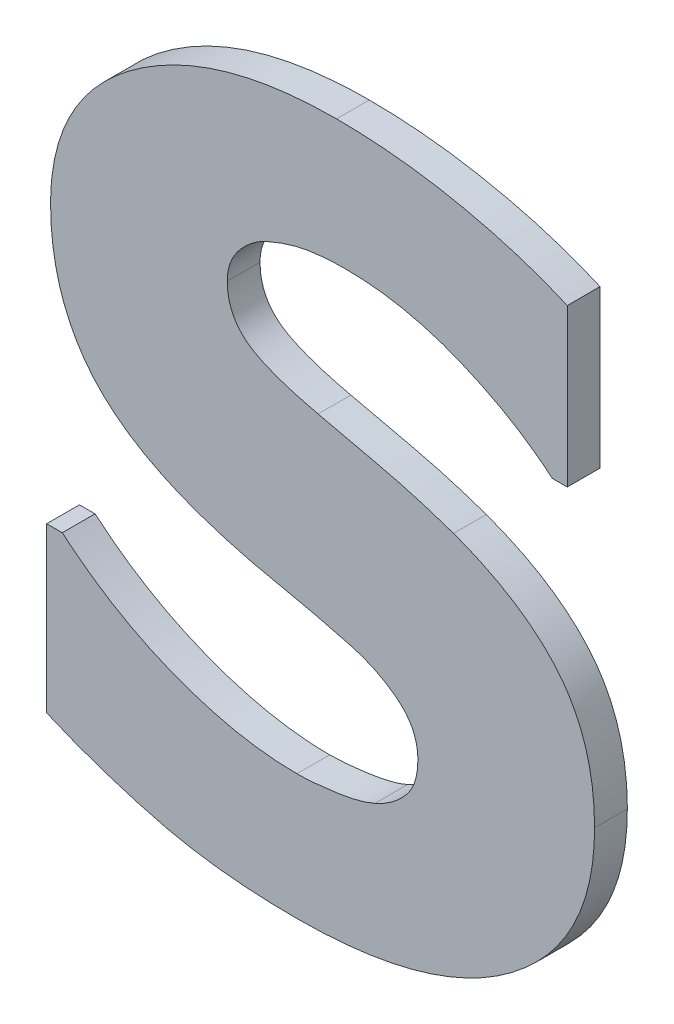
ISO-10303-21;
HEADER;
FILE_DESCRIPTION(('STEP AP214'),'2;1');
FILE_NAME('part.step','',(''),(''),'','','');
FILE_SCHEMA(('AUTOMOTIVE_DESIGN { 1 0 10303 214 1 1 1 1 }'));
ENDSEC;
DATA;
#1=APPLICATION_CONTEXT('core data for automotive mechanical design processes');
#2=APPLICATION_PROTOCOL_DEFINITION('international standard','automotive_design',2000,#1);
#3=PRODUCT_CONTEXT('',#1,'mechanical');
#4=PRODUCT('Part','Part','',(#3));
#5=PRODUCT_RELATED_PRODUCT_CATEGORY('part','',(#4));
#6=PRODUCT_DEFINITION_FORMATION('','',#4);
#7=PRODUCT_DEFINITION_CONTEXT('part definition',#1,'design');
#8=PRODUCT_DEFINITION('design','',#6,#7);
#9=PRODUCT_DEFINITION_SHAPE('','',#8);
#10=(LENGTH_UNIT() NAMED_UNIT(*) SI_UNIT(.MILLI.,.METRE.));
#11=(NAMED_UNIT(*) PLANE_ANGLE_UNIT() SI_UNIT($,.RADIAN.));
#12=(NAMED_UNIT(*) SI_UNIT($,.STERADIAN.) SOLID_ANGLE_UNIT());
#13=UNCERTAINTY_MEASURE_WITH_UNIT(LENGTH_MEASURE(1.E-05),#10,'distance_accuracy_value','');
#14=(GEOMETRIC_REPRESENTATION_CONTEXT(3) GLOBAL_UNCERTAINTY_ASSIGNED_CONTEXT((#13)) GLOBAL_UNIT_ASSIGNED_CONTEXT((#10,
#11,#12)) REPRESENTATION_CONTEXT('',''));
#15=CARTESIAN_POINT('',(0.,0.,0.));
#16=DIRECTION('',(0.,0.,1.));
#17=DIRECTION('',(1.,0.,0.));
#18=AXIS2_PLACEMENT_3D('',#15,#16,#17);
#19=CARTESIAN_POINT('',(3.2352198611794,-3.1542803303733,0.0475));
#20=DIRECTION('',(-1.,0.,0.));
#21=DIRECTION('',(0.,-1.,0.));
#22=AXIS2_PLACEMENT_3D('',#19,#20,#21);
#23=PLANE('',#22);
#24=DIRECTION('',(0.,1.,0.));
#25=VECTOR('',#24,1.);
#26=CARTESIAN_POINT('',(3.2352198611794,-3.1792965370477,0.0475));
#27=LINE('',#26,#25);
#28=CARTESIAN_POINT('',(3.2352198611794,-3.1792965370477,0.0475));
#29=VERTEX_POINT('',#28);
#30=CARTESIAN_POINT('',(3.2352198611794,-3.1542803303733,0.0475));
#31=VERTEX_POINT('',#30);
#32=EDGE_CURVE('E11',#29,#31,#27,.T.);
#33=ORIENTED_EDGE('',*,*,#32,.F.);
#34=DIRECTION('',(0.,0.,1.));
#35=VECTOR('',#34,1.);
#36=CARTESIAN_POINT('',(3.2352198611794,-3.1792965370477,0.0475));
#37=LINE('',#36,#35);
#38=CARTESIAN_POINT('',(3.2352198611794,-3.1792965370477,0.0525));
#39=VERTEX_POINT('',#38);
#40=EDGE_CURVE('E24',#29,#39,#37,.T.);
#41=ORIENTED_EDGE('',*,*,#40,.T.);
#42=DIRECTION('',(0.,-1.,0.));
#43=VECTOR('',#42,1.);
#44=CARTESIAN_POINT('',(3.2352198611794,-3.1792965370477,0.0525));
#45=LINE('',#44,#43);
#46=CARTESIAN_POINT('',(3.2352198611794,-3.1542803303733,0.0525));
#47=VERTEX_POINT('',#46);
#48=EDGE_CURVE('E172',#47,#39,#45,.T.);
#49=ORIENTED_EDGE('',*,*,#48,.F.);
#50=DIRECTION('',(0.,0.,1.));
#51=VECTOR('',#50,1.);
#52=CARTESIAN_POINT('',(3.2352198611794,-3.1542803303733,0.0475));
#53=LINE('',#52,#51);
#54=EDGE_CURVE('E469',#31,#47,#53,.T.);
#55=ORIENTED_EDGE('',*,*,#54,.F.);
#56=EDGE_LOOP('',(#33,#41,#49,#55));
#57=FACE_BOUND('',#56,.T.);
#58=ADVANCED_FACE('F17',(#57),#23,.T.);
#59=CARTESIAN_POINT('',(3.2376023570532,-3.1542803303733,0.0475));
#60=DIRECTION('',(0.,1.,0.));
#61=DIRECTION('',(-1.,0.,0.));
#62=AXIS2_PLACEMENT_3D('',#59,#60,#61);
#63=PLANE('',#62);
#64=DIRECTION('',(1.,0.,0.));
#65=VECTOR('',#64,1.);
#66=CARTESIAN_POINT('',(3.2352198611794,-3.1542803303733,0.0475));
#67=LINE('',#66,#65);
#68=CARTESIAN_POINT('',(3.2376023570532,-3.1542803303733,0.0475));
#69=VERTEX_POINT('',#68);
#70=EDGE_CURVE('E467',#31,#69,#67,.T.);
#71=ORIENTED_EDGE('',*,*,#70,.F.);
#72=ORIENTED_EDGE('',*,*,#54,.T.);
#73=DIRECTION('',(-1.,0.,0.));
#74=VECTOR('',#73,1.);
#75=CARTESIAN_POINT('',(3.2352198611794,-3.1542803303733,0.0525));
#76=LINE('',#75,#74);
#77=CARTESIAN_POINT('',(3.2376023570532,-3.1542803303733,0.0525));
#78=VERTEX_POINT('',#77);
#79=EDGE_CURVE('E465',#78,#47,#76,.T.);
#80=ORIENTED_EDGE('',*,*,#79,.F.);
#81=DIRECTION('',(0.,0.,1.));
#82=VECTOR('',#81,1.);
#83=CARTESIAN_POINT('',(3.2376023570532,-3.1542803303733,0.0475));
#84=LINE('',#83,#82);
#85=EDGE_CURVE('E459',#69,#78,#84,.T.);
#86=ORIENTED_EDGE('',*,*,#85,.F.);
#87=EDGE_LOOP('',(#71,#72,#80,#86));
#88=FACE_BOUND('',#87,.T.);
#89=ADVANCED_FACE('F539',(#88),#63,.T.);
#90=CARTESIAN_POINT('',(3.2734248842978,-3.1682349490624,0.0475));
#91=CARTESIAN_POINT('',(3.2734248842978,-3.1682349490624,0.0525));
#92=CARTESIAN_POINT('',(3.2644905247712,-3.1682349490624,0.0475));
#93=CARTESIAN_POINT('',(3.2644905247712,-3.1682349490624,0.0525));
#94=CARTESIAN_POINT('',(3.2455156469196,-3.1610023723028,0.0475));
#95=CARTESIAN_POINT('',(3.2455156469196,-3.1610023723028,0.0525));
#96=CARTESIAN_POINT('',(3.2376023570532,-3.1542803303733,0.0475));
#97=CARTESIAN_POINT('',(3.2376023570532,-3.1542803303733,0.0525));
#98=B_SPLINE_SURFACE_WITH_KNOTS('',2,1,((#90,#91),(#92,#93),(#94,#95),(#96,#97)),.UNSPECIFIED.,
.F.,.F.,.F.,(3,1,3),(2,2),(-2.,-1.,0.),(0.,0.01),.UNSPECIFIED.);
#99=CARTESIAN_POINT('',(3.2376023570532,-3.1542803303733,0.0475));
#100=CARTESIAN_POINT('',(3.2455156469196,-3.1610023723028,0.0475));
#101=CARTESIAN_POINT('',(3.2644905247712,-3.1682349490624,0.0475));
#102=CARTESIAN_POINT('',(3.2734248842978,-3.1682349490624,0.0475));
#103=B_SPLINE_CURVE_WITH_KNOTS('',2,(#99,#100,#101,#102),.UNSPECIFIED.,.F.,.F.,(3,1,3),(0.,1.,
2.),.UNSPECIFIED.);
#104=CARTESIAN_POINT('',(3.2734248842978,-3.1682349490624,0.0475));
#105=VERTEX_POINT('',#104);
#106=EDGE_CURVE('E452',#69,#105,#103,.T.);
#107=CARTESIAN_POINT('',(3.2734248842978,-3.1682349490624,0.0525));
#108=CARTESIAN_POINT('',(3.2644905247712,-3.1682349490624,0.0525));
#109=CARTESIAN_POINT('',(3.2455156469196,-3.1610023723028,0.0525));
#110=CARTESIAN_POINT('',(3.2376023570532,-3.1542803303733,0.0525));
#111=B_SPLINE_CURVE_WITH_KNOTS('',2,(#107,#108,#109,#110),.UNSPECIFIED.,.F.,.F.,(3,1,3),(-2.,
-1.,0.),.UNSPECIFIED.);
#112=CARTESIAN_POINT('',(3.2734248842978,-3.1682349490624,0.0525));
#113=VERTEX_POINT('',#112);
#114=EDGE_CURVE('E447',#113,#78,#111,.T.);
#115=DIRECTION('',(0.,0.,1.));
#116=VECTOR('',#115,1.);
#117=CARTESIAN_POINT('',(3.2734248842978,-3.1682349490624,0.0475));
#118=LINE('',#117,#116);
#119=EDGE_CURVE('E441',#105,#113,#118,.T.);
#120=ORIENTED_EDGE('',*,*,#106,.F.);
#121=ORIENTED_EDGE('',*,*,#85,.T.);
#122=ORIENTED_EDGE('',*,*,#114,.F.);
#123=ORIENTED_EDGE('',*,*,#119,.F.);
#124=EDGE_LOOP('',(#120,#121,#122,#123));
#125=FACE_BOUND('',#124,.T.);
#126=ADVANCED_FACE('F535',(#125),#98,.T.);
#127=CARTESIAN_POINT('',(3.2853373636666,-3.1661928097421,0.0475));
#128=CARTESIAN_POINT('',(3.2853373636666,-3.1661928097421,0.0525));
#129=CARTESIAN_POINT('',(3.2831250460695,-3.1672138794022,0.0475));
#130=CARTESIAN_POINT('',(3.2831250460695,-3.1672138794022,0.0525));
#131=CARTESIAN_POINT('',(3.2757222910332,-3.1682349490624,0.0475));
#132=CARTESIAN_POINT('',(3.2757222910332,-3.1682349490624,0.0525));
#133=CARTESIAN_POINT('',(3.2734248842978,-3.1682349490624,0.0475));
#134=CARTESIAN_POINT('',(3.2734248842978,-3.1682349490624,0.0525));
#135=B_SPLINE_SURFACE_WITH_KNOTS('',2,1,((#127,#128),(#129,#130),(#131,#132),(#133,#134)),
.UNSPECIFIED.,.F.,.F.,.F.,(3,1,3),(2,2),(-2.,-1.,0.),(0.,0.01),.UNSPECIFIED.);
#136=CARTESIAN_POINT('',(3.2734248842978,-3.1682349490624,0.0475));
#137=CARTESIAN_POINT('',(3.2757222910332,-3.1682349490624,0.0475));
#138=CARTESIAN_POINT('',(3.2831250460695,-3.1672138794022,0.0475));
#139=CARTESIAN_POINT('',(3.2853373636666,-3.1661928097421,0.0475));
#140=B_SPLINE_CURVE_WITH_KNOTS('',2,(#136,#137,#138,#139),.UNSPECIFIED.,.F.,.F.,(3,1,3),(0.,1.,
2.),.UNSPECIFIED.);
#141=CARTESIAN_POINT('',(3.2853373636666,-3.1661928097421,0.0475));
#142=VERTEX_POINT('',#141);
#143=EDGE_CURVE('E434',#105,#142,#140,.T.);
#144=CARTESIAN_POINT('',(3.2853373636666,-3.1661928097421,0.0525));
#145=CARTESIAN_POINT('',(3.2831250460695,-3.1672138794022,0.0525));
#146=CARTESIAN_POINT('',(3.2757222910332,-3.1682349490624,0.0525));
#147=CARTESIAN_POINT('',(3.2734248842978,-3.1682349490624,0.0525));
#148=B_SPLINE_CURVE_WITH_KNOTS('',2,(#144,#145,#146,#147),.UNSPECIFIED.,.F.,.F.,(3,1,3),(-2.,
-1.,0.),.UNSPECIFIED.);
#149=CARTESIAN_POINT('',(3.2853373636666,-3.1661928097421,0.0525));
#150=VERTEX_POINT('',#149);
#151=EDGE_CURVE('E429',#150,#113,#148,.T.);
#152=DIRECTION('',(0.,0.,1.));
#153=VECTOR('',#152,1.);
#154=CARTESIAN_POINT('',(3.2853373636666,-3.1661928097421,0.0475));
#155=LINE('',#154,#153);
#156=EDGE_CURVE('E423',#142,#150,#155,.T.);
#157=ORIENTED_EDGE('',*,*,#143,.F.);
#158=ORIENTED_EDGE('',*,*,#119,.T.);
#159=ORIENTED_EDGE('',*,*,#151,.F.);
#160=ORIENTED_EDGE('',*,*,#156,.F.);
#161=EDGE_LOOP('',(#157,#158,#159,#160));
#162=FACE_BOUND('',#161,.T.);
#163=ADVANCED_FACE('F531',(#162),#135,.T.);
#164=CARTESIAN_POINT('',(3.2918892273194,-3.1571733610771,0.0475));
#165=CARTESIAN_POINT('',(3.2918892273194,-3.1571733610771,0.0525));
#166=CARTESIAN_POINT('',(3.2918892273194,-3.1606620157494,0.0475));
#167=CARTESIAN_POINT('',(3.2918892273194,-3.1606620157494,0.0525));
#168=CARTESIAN_POINT('',(3.2880602160937,-3.1650015618052,0.0475));
#169=CARTESIAN_POINT('',(3.2880602160937,-3.1650015618052,0.0525));
#170=CARTESIAN_POINT('',(3.2853373636666,-3.1661928097421,0.0475));
#171=CARTESIAN_POINT('',(3.2853373636666,-3.1661928097421,0.0525));
#172=B_SPLINE_SURFACE_WITH_KNOTS('',2,1,((#164,#165),(#166,#167),(#168,#169),(#170,#171)),
.UNSPECIFIED.,.F.,.F.,.F.,(3,1,3),(2,2),(-2.,-1.,0.),(0.,0.01),.UNSPECIFIED.);
#173=CARTESIAN_POINT('',(3.2853373636666,-3.1661928097421,0.0475));
#174=CARTESIAN_POINT('',(3.2880602160937,-3.1650015618052,0.0475));
#175=CARTESIAN_POINT('',(3.2918892273194,-3.1606620157494,0.0475));
#176=CARTESIAN_POINT('',(3.2918892273194,-3.1571733610771,0.0475));
#177=B_SPLINE_CURVE_WITH_KNOTS('',2,(#173,#174,#175,#176),.UNSPECIFIED.,.F.,.F.,(3,1,3),(0.,1.,
2.),.UNSPECIFIED.);
#178=CARTESIAN_POINT('',(3.2918892273194,-3.1571733610771,0.0475));
#179=VERTEX_POINT('',#178);
#180=EDGE_CURVE('E416',#142,#179,#177,.T.);
#181=CARTESIAN_POINT('',(3.2918892273194,-3.1571733610771,0.0525));
#182=CARTESIAN_POINT('',(3.2918892273194,-3.1606620157494,0.0525));
#183=CARTESIAN_POINT('',(3.2880602160937,-3.1650015618052,0.0525));
#184=CARTESIAN_POINT('',(3.2853373636666,-3.1661928097421,0.0525));
#185=B_SPLINE_CURVE_WITH_KNOTS('',2,(#181,#182,#183,#184),.UNSPECIFIED.,.F.,.F.,(3,1,3),(-2.,
-1.,0.),.UNSPECIFIED.);
#186=CARTESIAN_POINT('',(3.2918892273194,-3.1571733610771,0.0525));
#187=VERTEX_POINT('',#186);
#188=EDGE_CURVE('E411',#187,#150,#185,.T.);
#189=DIRECTION('',(0.,0.,1.));
#190=VECTOR('',#189,1.);
#191=CARTESIAN_POINT('',(3.2918892273194,-3.1571733610771,0.0475));
#192=LINE('',#191,#190);
#193=EDGE_CURVE('E405',#179,#187,#192,.T.);
#194=ORIENTED_EDGE('',*,*,#180,.F.);
#195=ORIENTED_EDGE('',*,*,#156,.T.);
#196=ORIENTED_EDGE('',*,*,#188,.F.);
#197=ORIENTED_EDGE('',*,*,#193,.F.);
#198=EDGE_LOOP('',(#194,#195,#196,#197));
#199=FACE_BOUND('',#198,.T.);
#200=ADVANCED_FACE('F527',(#199),#172,.T.);
#201=CARTESIAN_POINT('',(3.2814232633025,-3.147132842752,0.0475));
#202=CARTESIAN_POINT('',(3.2814232633025,-3.147132842752,0.0525));
#203=CARTESIAN_POINT('',(3.28567772022,-3.1482390015506,0.0475));
#204=CARTESIAN_POINT('',(3.28567772022,-3.1482390015506,0.0525));
#205=CARTESIAN_POINT('',(3.2918892273194,-3.1531741715748,0.0475));
#206=CARTESIAN_POINT('',(3.2918892273194,-3.1531741715748,0.0525));
#207=CARTESIAN_POINT('',(3.2918892273194,-3.1571733610771,0.0475));
#208=CARTESIAN_POINT('',(3.2918892273194,-3.1571733610771,0.0525));
#209=B_SPLINE_SURFACE_WITH_KNOTS('',2,1,((#201,#202),(#203,#204),(#205,#206),(#207,#208)),
.UNSPECIFIED.,.F.,.F.,.F.,(3,1,3),(2,2),(-2.,-1.,0.),(0.,0.01),.UNSPECIFIED.);
#210=CARTESIAN_POINT('',(3.2918892273194,-3.1571733610771,0.0475));
#211=CARTESIAN_POINT('',(3.2918892273194,-3.1531741715748,0.0475));
#212=CARTESIAN_POINT('',(3.28567772022,-3.1482390015506,0.0475));
#213=CARTESIAN_POINT('',(3.2814232633025,-3.147132842752,0.0475));
#214=B_SPLINE_CURVE_WITH_KNOTS('',2,(#210,#211,#212,#213),.UNSPECIFIED.,.F.,.F.,(3,1,3),(0.,1.,
2.),.UNSPECIFIED.);
#215=CARTESIAN_POINT('',(3.2814232633025,-3.147132842752,0.0475));
#216=VERTEX_POINT('',#215);
#217=EDGE_CURVE('E398',#179,#216,#214,.T.);
#218=CARTESIAN_POINT('',(3.2814232633025,-3.147132842752,0.0525));
#219=CARTESIAN_POINT('',(3.28567772022,-3.1482390015506,0.0525));
#220=CARTESIAN_POINT('',(3.2918892273194,-3.1531741715748,0.0525));
#221=CARTESIAN_POINT('',(3.2918892273194,-3.1571733610771,0.0525));
#222=B_SPLINE_CURVE_WITH_KNOTS('',2,(#218,#219,#220,#221),.UNSPECIFIED.,.F.,.F.,(3,1,3),(-2.,
-1.,0.),.UNSPECIFIED.);
#223=CARTESIAN_POINT('',(3.2814232633025,-3.147132842752,0.0525));
#224=VERTEX_POINT('',#223);
#225=EDGE_CURVE('E393',#224,#187,#222,.T.);
#226=DIRECTION('',(0.,0.,1.));
#227=VECTOR('',#226,1.);
#228=CARTESIAN_POINT('',(3.2814232633025,-3.147132842752,0.0475));
#229=LINE('',#228,#227);
#230=EDGE_CURVE('E387',#216,#224,#229,.T.);
#231=ORIENTED_EDGE('',*,*,#217,.F.);
#232=ORIENTED_EDGE('',*,*,#193,.T.);
#233=ORIENTED_EDGE('',*,*,#225,.F.);
#234=ORIENTED_EDGE('',*,*,#230,.F.);
#235=EDGE_LOOP('',(#231,#232,#233,#234));
#236=FACE_BOUND('',#235,.T.);
#237=ADVANCED_FACE('F523',(#236),#209,.T.);
#238=CARTESIAN_POINT('',(3.2585342850869,-3.1413467813444,0.0475));
#239=CARTESIAN_POINT('',(3.2585342850869,-3.1413467813444,0.0525));
#240=CARTESIAN_POINT('',(3.2638949008028,-3.143218742388,0.0475));
#241=CARTESIAN_POINT('',(3.2638949008028,-3.143218742388,0.0525));
#242=CARTESIAN_POINT('',(3.2760626475866,-3.1456863274001,0.0475));
#243=CARTESIAN_POINT('',(3.2760626475866,-3.1456863274001,0.0525));
#244=CARTESIAN_POINT('',(3.2814232633025,-3.147132842752,0.0475));
#245=CARTESIAN_POINT('',(3.2814232633025,-3.147132842752,0.0525));
#246=B_SPLINE_SURFACE_WITH_KNOTS('',2,1,((#238,#239),(#240,#241),(#242,#243),(#244,#245)),
.UNSPECIFIED.,.F.,.F.,.F.,(3,1,3),(2,2),(-2.,-1.,0.),(0.,0.01),.UNSPECIFIED.);
#247=CARTESIAN_POINT('',(3.2814232633025,-3.147132842752,0.0475));
#248=CARTESIAN_POINT('',(3.2760626475866,-3.1456863274001,0.0475));
#249=CARTESIAN_POINT('',(3.2638949008028,-3.143218742388,0.0475));
#250=CARTESIAN_POINT('',(3.2585342850869,-3.1413467813444,0.0475));
#251=B_SPLINE_CURVE_WITH_KNOTS('',2,(#247,#248,#249,#250),.UNSPECIFIED.,.F.,.F.,(3,1,3),(0.,1.,
2.),.UNSPECIFIED.);
#252=CARTESIAN_POINT('',(3.2585342850869,-3.1413467813444,0.0475));
#253=VERTEX_POINT('',#252);
#254=EDGE_CURVE('E380',#216,#253,#251,.T.);
#255=CARTESIAN_POINT('',(3.2585342850869,-3.1413467813444,0.0525));
#256=CARTESIAN_POINT('',(3.2638949008028,-3.143218742388,0.0525));
#257=CARTESIAN_POINT('',(3.2760626475866,-3.1456863274001,0.0525));
#258=CARTESIAN_POINT('',(3.2814232633025,-3.147132842752,0.0525));
#259=B_SPLINE_CURVE_WITH_KNOTS('',2,(#255,#256,#257,#258),.UNSPECIFIED.,.F.,.F.,(3,1,3),(-2.,
-1.,0.),.UNSPECIFIED.);
#260=CARTESIAN_POINT('',(3.2585342850869,-3.1413467813444,0.0525));
#261=VERTEX_POINT('',#260);
#262=EDGE_CURVE('E375',#261,#224,#259,.T.);
#263=DIRECTION('',(0.,0.,1.));
#264=VECTOR('',#263,1.);
#265=CARTESIAN_POINT('',(3.2585342850869,-3.1413467813444,0.0475));
#266=LINE('',#265,#264);
#267=EDGE_CURVE('E369',#253,#261,#266,.T.);
#268=ORIENTED_EDGE('',*,*,#254,.F.);
#269=ORIENTED_EDGE('',*,*,#230,.T.);
#270=ORIENTED_EDGE('',*,*,#262,.F.);
#271=ORIENTED_EDGE('',*,*,#267,.F.);
#272=EDGE_LOOP('',(#268,#269,#270,#271));
#273=FACE_BOUND('',#272,.T.);
#274=ADVANCED_FACE('F519',(#273),#246,.T.);
#275=CARTESIAN_POINT('',(3.2358154851479,-3.1116506720608,0.0475));
#276=CARTESIAN_POINT('',(3.2358154851479,-3.1116506720608,0.0525));
#277=CARTESIAN_POINT('',(3.2358154851479,-3.1225420817694,0.0475));
#278=CARTESIAN_POINT('',(3.2358154851479,-3.1225420817694,0.0525));
#279=CARTESIAN_POINT('',(3.2463665383031,-3.1370923244269,0.0475));
#280=CARTESIAN_POINT('',(3.2463665383031,-3.1370923244269,0.0525));
#281=CARTESIAN_POINT('',(3.2585342850869,-3.1413467813444,0.0475));
#282=CARTESIAN_POINT('',(3.2585342850869,-3.1413467813444,0.0525));
#283=B_SPLINE_SURFACE_WITH_KNOTS('',2,1,((#275,#276),(#277,#278),(#279,#280),(#281,#282)),
.UNSPECIFIED.,.F.,.F.,.F.,(3,1,3),(2,2),(-2.,-1.,0.),(0.,0.01),.UNSPECIFIED.);
#284=CARTESIAN_POINT('',(3.2585342850869,-3.1413467813444,0.0475));
#285=CARTESIAN_POINT('',(3.2463665383031,-3.1370923244269,0.0475));
#286=CARTESIAN_POINT('',(3.2358154851479,-3.1225420817694,0.0475));
#287=CARTESIAN_POINT('',(3.2358154851479,-3.1116506720608,0.0475));
#288=B_SPLINE_CURVE_WITH_KNOTS('',2,(#284,#285,#286,#287),.UNSPECIFIED.,.F.,.F.,(3,1,3),(0.,1.,
2.),.UNSPECIFIED.);
#289=CARTESIAN_POINT('',(3.2358154851479,-3.1116506720608,0.0475));
#290=VERTEX_POINT('',#289);
#291=EDGE_CURVE('E362',#253,#290,#288,.T.);
#292=CARTESIAN_POINT('',(3.2358154851479,-3.1116506720608,0.0525));
#293=CARTESIAN_POINT('',(3.2358154851479,-3.1225420817694,0.0525));
#294=CARTESIAN_POINT('',(3.2463665383031,-3.1370923244269,0.0525));
#295=CARTESIAN_POINT('',(3.2585342850869,-3.1413467813444,0.0525));
#296=B_SPLINE_CURVE_WITH_KNOTS('',2,(#292,#293,#294,#295),.UNSPECIFIED.,.F.,.F.,(3,1,3),(-2.,
-1.,0.),.UNSPECIFIED.);
#297=CARTESIAN_POINT('',(3.2358154851479,-3.1116506720608,0.0525));
#298=VERTEX_POINT('',#297);
#299=EDGE_CURVE('E357',#298,#261,#296,.T.);
#300=DIRECTION('',(0.,0.,1.));
#301=VECTOR('',#300,1.);
#302=CARTESIAN_POINT('',(3.2358154851479,-3.1116506720608,0.0475));
#303=LINE('',#302,#301);
#304=EDGE_CURVE('E351',#290,#298,#303,.T.);
#305=ORIENTED_EDGE('',*,*,#291,.F.);
#306=ORIENTED_EDGE('',*,*,#267,.T.);
#307=ORIENTED_EDGE('',*,*,#299,.F.);
#308=ORIENTED_EDGE('',*,*,#304,.F.);
#309=EDGE_LOOP('',(#305,#306,#307,#308));
#310=FACE_BOUND('',#309,.T.);
#311=ADVANCED_FACE('F515',(#310),#283,.T.);
#312=CARTESIAN_POINT('',(3.2794662131205,-3.0786360863817,0.0475));
#313=CARTESIAN_POINT('',(3.2794662131205,-3.0786360863817,0.0525));
#314=CARTESIAN_POINT('',(3.2607466026839,-3.0786360863817,0.0475));
#315=CARTESIAN_POINT('',(3.2607466026839,-3.0786360863817,0.0525));
#316=CARTESIAN_POINT('',(3.2358154851479,-3.0969302511266,0.0475));
#317=CARTESIAN_POINT('',(3.2358154851479,-3.0969302511266,0.0525));
#318=CARTESIAN_POINT('',(3.2358154851479,-3.1116506720608,0.0475));
#319=CARTESIAN_POINT('',(3.2358154851479,-3.1116506720608,0.0525));
#320=B_SPLINE_SURFACE_WITH_KNOTS('',2,1,((#312,#313),(#314,#315),(#316,#317),(#318,#319)),
.UNSPECIFIED.,.F.,.F.,.F.,(3,1,3),(2,2),(-2.,-1.,0.),(0.,0.01),.UNSPECIFIED.);
#321=CARTESIAN_POINT('',(3.2358154851479,-3.1116506720608,0.0475));
#322=CARTESIAN_POINT('',(3.2358154851479,-3.0969302511266,0.0475));
#323=CARTESIAN_POINT('',(3.2607466026839,-3.0786360863817,0.0475));
#324=CARTESIAN_POINT('',(3.2794662131205,-3.0786360863817,0.0475));
#325=B_SPLINE_CURVE_WITH_KNOTS('',2,(#321,#322,#323,#324),.UNSPECIFIED.,.F.,.F.,(3,1,3),(0.,1.,
2.),.UNSPECIFIED.);
#326=CARTESIAN_POINT('',(3.2794662131205,-3.0786360863817,0.0475));
#327=VERTEX_POINT('',#326);
#328=EDGE_CURVE('E344',#290,#327,#325,.T.);
#329=CARTESIAN_POINT('',(3.2794662131205,-3.0786360863817,0.0525));
#330=CARTESIAN_POINT('',(3.2607466026839,-3.0786360863817,0.0525));
#331=CARTESIAN_POINT('',(3.2358154851479,-3.0969302511266,0.0525));
#332=CARTESIAN_POINT('',(3.2358154851479,-3.1116506720608,0.0525));
#333=B_SPLINE_CURVE_WITH_KNOTS('',2,(#329,#330,#331,#332),.UNSPECIFIED.,.F.,.F.,(3,1,3),(-2.,
-1.,0.),.UNSPECIFIED.);
#334=CARTESIAN_POINT('',(3.2794662131205,-3.0786360863817,0.0525));
#335=VERTEX_POINT('',#334);
#336=EDGE_CURVE('E339',#335,#298,#333,.T.);
#337=DIRECTION('',(0.,0.,1.));
#338=VECTOR('',#337,1.);
#339=CARTESIAN_POINT('',(3.2794662131205,-3.0786360863817,0.0475));
#340=LINE('',#339,#338);
#341=EDGE_CURVE('E333',#327,#335,#340,.T.);
#342=ORIENTED_EDGE('',*,*,#328,.F.);
#343=ORIENTED_EDGE('',*,*,#304,.T.);
#344=ORIENTED_EDGE('',*,*,#336,.F.);
#345=ORIENTED_EDGE('',*,*,#341,.F.);
#346=EDGE_LOOP('',(#342,#343,#344,#345));
#347=FACE_BOUND('',#346,.T.);
#348=ADVANCED_FACE('F511',(#347),#320,.T.);
#349=CARTESIAN_POINT('',(3.3146931163967,-3.0856984848646,0.0475));
#350=CARTESIAN_POINT('',(3.3146931163967,-3.0856984848646,0.0525));
#351=CARTESIAN_POINT('',(3.3073754504988,-3.0824650976074,0.0475));
#352=CARTESIAN_POINT('',(3.3073754504988,-3.0824650976074,0.0525));
#353=CARTESIAN_POINT('',(3.2888260183388,-3.0786360863817,0.0475));
#354=CARTESIAN_POINT('',(3.2888260183388,-3.0786360863817,0.0525));
#355=CARTESIAN_POINT('',(3.2794662131205,-3.0786360863817,0.0475));
#356=CARTESIAN_POINT('',(3.2794662131205,-3.0786360863817,0.0525));
#357=B_SPLINE_SURFACE_WITH_KNOTS('',2,1,((#349,#350),(#351,#352),(#353,#354),(#355,#356)),
.UNSPECIFIED.,.F.,.F.,.F.,(3,1,3),(2,2),(-2.,-1.,0.),(0.,0.01),.UNSPECIFIED.);
#358=CARTESIAN_POINT('',(3.2794662131205,-3.0786360863817,0.0475));
#359=CARTESIAN_POINT('',(3.2888260183388,-3.0786360863817,0.0475));
#360=CARTESIAN_POINT('',(3.3073754504988,-3.0824650976074,0.0475));
#361=CARTESIAN_POINT('',(3.3146931163967,-3.0856984848646,0.0475));
#362=B_SPLINE_CURVE_WITH_KNOTS('',2,(#358,#359,#360,#361),.UNSPECIFIED.,.F.,.F.,(3,1,3),(0.,1.,
2.),.UNSPECIFIED.);
#363=CARTESIAN_POINT('',(3.3146931163967,-3.0856984848646,0.0475));
#364=VERTEX_POINT('',#363);
#365=EDGE_CURVE('E326',#327,#364,#362,.T.);
#366=CARTESIAN_POINT('',(3.3146931163967,-3.0856984848646,0.0525));
#367=CARTESIAN_POINT('',(3.3073754504988,-3.0824650976074,0.0525));
#368=CARTESIAN_POINT('',(3.2888260183388,-3.0786360863817,0.0525));
#369=CARTESIAN_POINT('',(3.2794662131205,-3.0786360863817,0.0525));
#370=B_SPLINE_CURVE_WITH_KNOTS('',2,(#366,#367,#368,#369),.UNSPECIFIED.,.F.,.F.,(3,1,3),(-2.,
-1.,0.),.UNSPECIFIED.);
#371=CARTESIAN_POINT('',(3.3146931163967,-3.0856984848646,0.0525));
#372=VERTEX_POINT('',#371);
#373=EDGE_CURVE('E321',#372,#335,#370,.T.);
#374=DIRECTION('',(0.,0.,1.));
#375=VECTOR('',#374,1.);
#376=CARTESIAN_POINT('',(3.3146931163967,-3.0856984848646,0.0475));
#377=LINE('',#376,#375);
#378=EDGE_CURVE('E318',#364,#372,#377,.T.);
#379=ORIENTED_EDGE('',*,*,#365,.F.);
#380=ORIENTED_EDGE('',*,*,#341,.T.);
#381=ORIENTED_EDGE('',*,*,#373,.F.);
#382=ORIENTED_EDGE('',*,*,#378,.F.);
#383=EDGE_LOOP('',(#379,#380,#381,#382));
#384=FACE_BOUND('',#383,.T.);
#385=ADVANCED_FACE('F507',(#384),#357,.T.);
#386=CARTESIAN_POINT('',(3.3146931163967,-3.1096936218788,0.0475));
#387=DIRECTION('',(1.,0.,0.));
#388=DIRECTION('',(0.,1.,0.));
#389=AXIS2_PLACEMENT_3D('',#386,#387,#388);
#390=PLANE('',#389);
#391=DIRECTION('',(0.,-1.,0.));
#392=VECTOR('',#391,1.);
#393=CARTESIAN_POINT('',(3.3146931163967,-3.0856984848646,0.0475));
#394=LINE('',#393,#392);
#395=CARTESIAN_POINT('',(3.3146931163967,-3.1096936218788,0.0475));
#396=VERTEX_POINT('',#395);
#397=EDGE_CURVE('E316',#364,#396,#394,.T.);
#398=ORIENTED_EDGE('',*,*,#397,.F.);
#399=ORIENTED_EDGE('',*,*,#378,.T.);
#400=DIRECTION('',(0.,1.,0.));
#401=VECTOR('',#400,1.);
#402=CARTESIAN_POINT('',(3.3146931163967,-3.0856984848646,0.0525));
#403=LINE('',#402,#401);
#404=CARTESIAN_POINT('',(3.3146931163967,-3.1096936218788,0.0525));
#405=VERTEX_POINT('',#404);
#406=EDGE_CURVE('E313',#405,#372,#403,.T.);
#407=ORIENTED_EDGE('',*,*,#406,.F.);
#408=DIRECTION('',(0.,0.,1.));
#409=VECTOR('',#408,1.);
#410=CARTESIAN_POINT('',(3.3146931163967,-3.1096936218788,0.0475));
#411=LINE('',#410,#409);
#412=EDGE_CURVE('E310',#396,#405,#411,.T.);
#413=ORIENTED_EDGE('',*,*,#412,.F.);
#414=EDGE_LOOP('',(#398,#399,#407,#413));
#415=FACE_BOUND('',#414,.T.);
#416=ADVANCED_FACE('F503',(#415),#390,.T.);
#417=CARTESIAN_POINT('',(3.3123957096613,-3.1096936218788,0.0475));
#418=DIRECTION('',(0.,-1.,0.));
#419=DIRECTION('',(1.,0.,0.));
#420=AXIS2_PLACEMENT_3D('',#417,#418,#419);
#421=PLANE('',#420);
#422=DIRECTION('',(-1.,0.,0.));
#423=VECTOR('',#422,1.);
#424=CARTESIAN_POINT('',(3.3146931163967,-3.1096936218788,0.0475));
#425=LINE('',#424,#423);
#426=CARTESIAN_POINT('',(3.3123957096613,-3.1096936218788,0.0475));
#427=VERTEX_POINT('',#426);
#428=EDGE_CURVE('E308',#396,#427,#425,.T.);
#429=ORIENTED_EDGE('',*,*,#428,.F.);
#430=ORIENTED_EDGE('',*,*,#412,.T.);
#431=DIRECTION('',(1.,0.,0.));
#432=VECTOR('',#431,1.);
#433=CARTESIAN_POINT('',(3.3146931163967,-3.1096936218788,0.0525));
#434=LINE('',#433,#432);
#435=CARTESIAN_POINT('',(3.3123957096613,-3.1096936218788,0.0525));
#436=VERTEX_POINT('',#435);
#437=EDGE_CURVE('E305',#436,#405,#434,.T.);
#438=ORIENTED_EDGE('',*,*,#437,.F.);
#439=DIRECTION('',(0.,0.,1.));
#440=VECTOR('',#439,1.);
#441=CARTESIAN_POINT('',(3.3123957096613,-3.1096936218788,0.0475));
#442=LINE('',#441,#440);
#443=EDGE_CURVE('E299',#427,#436,#442,.T.);
#444=ORIENTED_EDGE('',*,*,#443,.F.);
#445=EDGE_LOOP('',(#429,#430,#438,#444));
#446=FACE_BOUND('',#445,.T.);
#447=ADVANCED_FACE('F499',(#446),#421,.T.);
#448=CARTESIAN_POINT('',(3.2808276393341,-3.09778114251,0.0475));
#449=CARTESIAN_POINT('',(3.2808276393341,-3.09778114251,0.0525));
#450=CARTESIAN_POINT('',(3.2896769097223,-3.09778114251,0.0475));
#451=CARTESIAN_POINT('',(3.2896769097223,-3.09778114251,0.0525));
#452=CARTESIAN_POINT('',(3.3065245591153,-3.1046733627163,0.0475));
#453=CARTESIAN_POINT('',(3.3065245591153,-3.1046733627163,0.0525));
#454=CARTESIAN_POINT('',(3.3123957096613,-3.1096936218788,0.0475));
#455=CARTESIAN_POINT('',(3.3123957096613,-3.1096936218788,0.0525));
#456=B_SPLINE_SURFACE_WITH_KNOTS('',2,1,((#448,#449),(#450,#451),(#452,#453),(#454,#455)),
.UNSPECIFIED.,.F.,.F.,.F.,(3,1,3),(2,2),(-2.,-1.,0.),(0.,0.01),.UNSPECIFIED.);
#457=CARTESIAN_POINT('',(3.3123957096613,-3.1096936218788,0.0475));
#458=CARTESIAN_POINT('',(3.3065245591153,-3.1046733627163,0.0475));
#459=CARTESIAN_POINT('',(3.2896769097223,-3.09778114251,0.0475));
#460=CARTESIAN_POINT('',(3.2808276393341,-3.09778114251,0.0475));
#461=B_SPLINE_CURVE_WITH_KNOTS('',2,(#457,#458,#459,#460),.UNSPECIFIED.,.F.,.F.,(3,1,3),(0.,1.,
2.),.UNSPECIFIED.);
#462=CARTESIAN_POINT('',(3.2808276393341,-3.09778114251,0.0475));
#463=VERTEX_POINT('',#462);
#464=EDGE_CURVE('E292',#427,#463,#461,.T.);
#465=CARTESIAN_POINT('',(3.2808276393341,-3.09778114251,0.0525));
#466=CARTESIAN_POINT('',(3.2896769097223,-3.09778114251,0.0525));
#467=CARTESIAN_POINT('',(3.3065245591153,-3.1046733627163,0.0525));
#468=CARTESIAN_POINT('',(3.3123957096613,-3.1096936218788,0.0525));
#469=B_SPLINE_CURVE_WITH_KNOTS('',2,(#465,#466,#467,#468),.UNSPECIFIED.,.F.,.F.,(3,1,3),(-2.,
-1.,0.),.UNSPECIFIED.);
#470=CARTESIAN_POINT('',(3.2808276393341,-3.09778114251,0.0525));
#471=VERTEX_POINT('',#470);
#472=EDGE_CURVE('E287',#471,#436,#469,.T.);
#473=DIRECTION('',(0.,0.,1.));
#474=VECTOR('',#473,1.);
#475=CARTESIAN_POINT('',(3.2808276393341,-3.09778114251,0.0475));
#476=LINE('',#475,#474);
#477=EDGE_CURVE('E281',#463,#471,#476,.T.);
#478=ORIENTED_EDGE('',*,*,#464,.F.);
#479=ORIENTED_EDGE('',*,*,#443,.T.);
#480=ORIENTED_EDGE('',*,*,#472,.F.);
#481=ORIENTED_EDGE('',*,*,#477,.F.);
#482=EDGE_LOOP('',(#478,#479,#480,#481));
#483=FACE_BOUND('',#482,.T.);
#484=ADVANCED_FACE('F495',(#483),#456,.T.);
#485=CARTESIAN_POINT('',(3.268830070827,-3.1001636383838,0.0475));
#486=CARTESIAN_POINT('',(3.268830070827,-3.1001636383838,0.0525));
#487=CARTESIAN_POINT('',(3.2718932798075,-3.0988022121702,0.0475));
#488=CARTESIAN_POINT('',(3.2718932798075,-3.0988022121702,0.0525));
#489=CARTESIAN_POINT('',(3.2773389846618,-3.09778114251,0.0475));
#490=CARTESIAN_POINT('',(3.2773389846618,-3.09778114251,0.0525));
#491=CARTESIAN_POINT('',(3.2808276393341,-3.09778114251,0.0475));
#492=CARTESIAN_POINT('',(3.2808276393341,-3.09778114251,0.0525));
#493=B_SPLINE_SURFACE_WITH_KNOTS('',2,1,((#485,#486),(#487,#488),(#489,#490),(#491,#492)),
.UNSPECIFIED.,.F.,.F.,.F.,(3,1,3),(2,2),(-2.,-1.,0.),(0.,0.01),.UNSPECIFIED.);
#494=CARTESIAN_POINT('',(3.2808276393341,-3.09778114251,0.0475));
#495=CARTESIAN_POINT('',(3.2773389846618,-3.09778114251,0.0475));
#496=CARTESIAN_POINT('',(3.2718932798075,-3.0988022121702,0.0475));
#497=CARTESIAN_POINT('',(3.268830070827,-3.1001636383838,0.0475));
#498=B_SPLINE_CURVE_WITH_KNOTS('',2,(#494,#495,#496,#497),.UNSPECIFIED.,.F.,.F.,(3,1,3),(0.,1.,
2.),.UNSPECIFIED.);
#499=CARTESIAN_POINT('',(3.268830070827,-3.1001636383838,0.0475));
#500=VERTEX_POINT('',#499);
#501=EDGE_CURVE('E274',#463,#500,#498,.T.);
#502=CARTESIAN_POINT('',(3.268830070827,-3.1001636383838,0.0525));
#503=CARTESIAN_POINT('',(3.2718932798075,-3.0988022121702,0.0525));
#504=CARTESIAN_POINT('',(3.2773389846618,-3.09778114251,0.0525));
#505=CARTESIAN_POINT('',(3.2808276393341,-3.09778114251,0.0525));
#506=B_SPLINE_CURVE_WITH_KNOTS('',2,(#502,#503,#504,#505),.UNSPECIFIED.,.F.,.F.,(3,1,3),(-2.,
-1.,0.),.UNSPECIFIED.);
#507=CARTESIAN_POINT('',(3.268830070827,-3.1001636383838,0.0525));
#508=VERTEX_POINT('',#507);
#509=EDGE_CURVE('E269',#508,#471,#506,.T.);
#510=DIRECTION('',(0.,0.,1.));
#511=VECTOR('',#510,1.);
#512=CARTESIAN_POINT('',(3.268830070827,-3.1001636383838,0.0475));
#513=LINE('',#512,#511);
#514=EDGE_CURVE('E263',#500,#508,#513,.T.);
#515=ORIENTED_EDGE('',*,*,#501,.F.);
#516=ORIENTED_EDGE('',*,*,#477,.T.);
#517=ORIENTED_EDGE('',*,*,#509,.F.);
#518=ORIENTED_EDGE('',*,*,#514,.F.);
#519=EDGE_LOOP('',(#515,#516,#517,#518));
#520=FACE_BOUND('',#519,.T.);
#521=ADVANCED_FACE('F491',(#520),#493,.T.);
#522=CARTESIAN_POINT('',(3.2627887420043,-3.1084172848036,0.0475));
#523=CARTESIAN_POINT('',(3.2627887420043,-3.1084172848036,0.0525));
#524=CARTESIAN_POINT('',(3.2627887420043,-3.1056944323764,0.0475));
#525=CARTESIAN_POINT('',(3.2627887420043,-3.1056944323764,0.0525));
#526=CARTESIAN_POINT('',(3.2663624858149,-3.1012697971823,0.0475));
#527=CARTESIAN_POINT('',(3.2663624858149,-3.1012697971823,0.0525));
#528=CARTESIAN_POINT('',(3.268830070827,-3.1001636383838,0.0475));
#529=CARTESIAN_POINT('',(3.268830070827,-3.1001636383838,0.0525));
#530=B_SPLINE_SURFACE_WITH_KNOTS('',2,1,((#522,#523),(#524,#525),(#526,#527),(#528,#529)),
.UNSPECIFIED.,.F.,.F.,.F.,(3,1,3),(2,2),(-2.,-1.,0.),(0.,0.01),.UNSPECIFIED.);
#531=CARTESIAN_POINT('',(3.268830070827,-3.1001636383838,0.0475));
#532=CARTESIAN_POINT('',(3.2663624858149,-3.1012697971823,0.0475));
#533=CARTESIAN_POINT('',(3.2627887420043,-3.1056944323764,0.0475));
#534=CARTESIAN_POINT('',(3.2627887420043,-3.1084172848036,0.0475));
#535=B_SPLINE_CURVE_WITH_KNOTS('',2,(#531,#532,#533,#534),.UNSPECIFIED.,.F.,.F.,(3,1,3),(0.,1.,
2.),.UNSPECIFIED.);
#536=CARTESIAN_POINT('',(3.2627887420043,-3.1084172848036,0.0475));
#537=VERTEX_POINT('',#536);
#538=EDGE_CURVE('E256',#500,#537,#535,.T.);
#539=CARTESIAN_POINT('',(3.2627887420043,-3.1084172848036,0.0525));
#540=CARTESIAN_POINT('',(3.2627887420043,-3.1056944323764,0.0525));
#541=CARTESIAN_POINT('',(3.2663624858149,-3.1012697971823,0.0525));
#542=CARTESIAN_POINT('',(3.268830070827,-3.1001636383838,0.0525));
#543=B_SPLINE_CURVE_WITH_KNOTS('',2,(#539,#540,#541,#542),.UNSPECIFIED.,.F.,.F.,(3,1,3),(-2.,
-1.,0.),.UNSPECIFIED.);
#544=CARTESIAN_POINT('',(3.2627887420043,-3.1084172848036,0.0525));
#545=VERTEX_POINT('',#544);
#546=EDGE_CURVE('E251',#545,#508,#543,.T.);
#547=DIRECTION('',(0.,0.,1.));
#548=VECTOR('',#547,1.);
#549=CARTESIAN_POINT('',(3.2627887420043,-3.1084172848036,0.0475));
#550=LINE('',#549,#548);
#551=EDGE_CURVE('E245',#537,#545,#550,.T.);
#552=ORIENTED_EDGE('',*,*,#538,.F.);
#553=ORIENTED_EDGE('',*,*,#514,.T.);
#554=ORIENTED_EDGE('',*,*,#546,.F.);
#555=ORIENTED_EDGE('',*,*,#551,.F.);
#556=EDGE_LOOP('',(#552,#553,#554,#555));
#557=FACE_BOUND('',#556,.T.);
#558=ADVANCED_FACE('F487',(#557),#530,.T.);
#559=CARTESIAN_POINT('',(3.276658271555,-3.1190534270971,0.0475));
#560=CARTESIAN_POINT('',(3.276658271555,-3.1190534270971,0.0525));
#561=CARTESIAN_POINT('',(3.2684897142736,-3.1171814660535,0.0475));
#562=CARTESIAN_POINT('',(3.2684897142736,-3.1171814660535,0.0525));
#563=CARTESIAN_POINT('',(3.2627887420043,-3.1125015634443,0.0475));
#564=CARTESIAN_POINT('',(3.2627887420043,-3.1125015634443,0.0525));
#565=CARTESIAN_POINT('',(3.2627887420043,-3.1084172848036,0.0475));
#566=CARTESIAN_POINT('',(3.2627887420043,-3.1084172848036,0.0525));
#567=B_SPLINE_SURFACE_WITH_KNOTS('',2,1,((#559,#560),(#561,#562),(#563,#564),(#565,#566)),
.UNSPECIFIED.,.F.,.F.,.F.,(3,1,3),(2,2),(-2.,-1.,0.),(0.,0.01),.UNSPECIFIED.);
#568=CARTESIAN_POINT('',(3.2627887420043,-3.1084172848036,0.0475));
#569=CARTESIAN_POINT('',(3.2627887420043,-3.1125015634443,0.0475));
#570=CARTESIAN_POINT('',(3.2684897142736,-3.1171814660535,0.0475));
#571=CARTESIAN_POINT('',(3.276658271555,-3.1190534270971,0.0475));
#572=B_SPLINE_CURVE_WITH_KNOTS('',2,(#568,#569,#570,#571),.UNSPECIFIED.,.F.,.F.,(3,1,3),(0.,1.,
2.),.UNSPECIFIED.);
#573=CARTESIAN_POINT('',(3.276658271555,-3.1190534270971,0.0475));
#574=VERTEX_POINT('',#573);
#575=EDGE_CURVE('E238',#537,#574,#572,.T.);
#576=CARTESIAN_POINT('',(3.276658271555,-3.1190534270971,0.0525));
#577=CARTESIAN_POINT('',(3.2684897142736,-3.1171814660535,0.0525));
#578=CARTESIAN_POINT('',(3.2627887420043,-3.1125015634443,0.0525));
#579=CARTESIAN_POINT('',(3.2627887420043,-3.1084172848036,0.0525));
#580=B_SPLINE_CURVE_WITH_KNOTS('',2,(#576,#577,#578,#579),.UNSPECIFIED.,.F.,.F.,(3,1,3),(-2.,
-1.,0.),.UNSPECIFIED.);
#581=CARTESIAN_POINT('',(3.276658271555,-3.1190534270971,0.0525));
#582=VERTEX_POINT('',#581);
#583=EDGE_CURVE('E233',#582,#545,#580,.T.);
#584=DIRECTION('',(0.,0.,1.));
#585=VECTOR('',#584,1.);
#586=CARTESIAN_POINT('',(3.276658271555,-3.1190534270971,0.0475));
#587=LINE('',#586,#585);
#588=EDGE_CURVE('E227',#574,#582,#587,.T.);
#589=ORIENTED_EDGE('',*,*,#575,.F.);
#590=ORIENTED_EDGE('',*,*,#551,.T.);
#591=ORIENTED_EDGE('',*,*,#583,.F.);
#592=ORIENTED_EDGE('',*,*,#588,.F.);
#593=EDGE_LOOP('',(#589,#590,#591,#592));
#594=FACE_BOUND('',#593,.T.);
#595=ADVANCED_FACE('F483',(#594),#567,.T.);
#596=CARTESIAN_POINT('',(3.2973349321737,-3.1244991319514,0.0475));
#597=CARTESIAN_POINT('',(3.2973349321737,-3.1244991319514,0.0525));
#598=CARTESIAN_POINT('',(3.2917190490427,-3.1225420817694,0.0475));
#599=CARTESIAN_POINT('',(3.2917190490427,-3.1225420817694,0.0525));
#600=CARTESIAN_POINT('',(3.2819337981326,-3.120244675034,0.0475));
#601=CARTESIAN_POINT('',(3.2819337981326,-3.120244675034,0.0525));
#602=CARTESIAN_POINT('',(3.276658271555,-3.1190534270971,0.0475));
#603=CARTESIAN_POINT('',(3.276658271555,-3.1190534270971,0.0525));
#604=B_SPLINE_SURFACE_WITH_KNOTS('',2,1,((#596,#597),(#598,#599),(#600,#601),(#602,#603)),
.UNSPECIFIED.,.F.,.F.,.F.,(3,1,3),(2,2),(-2.,-1.,0.),(0.,0.01),.UNSPECIFIED.);
#605=CARTESIAN_POINT('',(3.276658271555,-3.1190534270971,0.0475));
#606=CARTESIAN_POINT('',(3.2819337981326,-3.120244675034,0.0475));
#607=CARTESIAN_POINT('',(3.2917190490427,-3.1225420817694,0.0475));
#608=CARTESIAN_POINT('',(3.2973349321737,-3.1244991319514,0.0475));
#609=B_SPLINE_CURVE_WITH_KNOTS('',2,(#605,#606,#607,#608),.UNSPECIFIED.,.F.,.F.,(3,1,3),(0.,1.,
2.),.UNSPECIFIED.);
#610=CARTESIAN_POINT('',(3.2973349321737,-3.1244991319514,0.0475));
#611=VERTEX_POINT('',#610);
#612=EDGE_CURVE('E220',#574,#611,#609,.T.);
#613=CARTESIAN_POINT('',(3.2973349321737,-3.1244991319514,0.0525));
#614=CARTESIAN_POINT('',(3.2917190490427,-3.1225420817694,0.0525));
#615=CARTESIAN_POINT('',(3.2819337981326,-3.120244675034,0.0525));
#616=CARTESIAN_POINT('',(3.276658271555,-3.1190534270971,0.0525));
#617=B_SPLINE_CURVE_WITH_KNOTS('',2,(#613,#614,#615,#616),.UNSPECIFIED.,.F.,.F.,(3,1,3),(-2.,
-1.,0.),.UNSPECIFIED.);
#618=CARTESIAN_POINT('',(3.2973349321737,-3.1244991319514,0.0525));
#619=VERTEX_POINT('',#618);
#620=EDGE_CURVE('E215',#619,#582,#617,.T.);
#621=DIRECTION('',(0.,0.,1.));
#622=VECTOR('',#621,1.);
#623=CARTESIAN_POINT('',(3.2973349321737,-3.1244991319514,0.0475));
#624=LINE('',#623,#622);
#625=EDGE_CURVE('E209',#611,#619,#624,.T.);
#626=ORIENTED_EDGE('',*,*,#612,.F.);
#627=ORIENTED_EDGE('',*,*,#588,.T.);
#628=ORIENTED_EDGE('',*,*,#620,.F.);
#629=ORIENTED_EDGE('',*,*,#625,.F.);
#630=EDGE_LOOP('',(#626,#627,#628,#629));
#631=FACE_BOUND('',#630,.T.);
#632=ADVANCED_FACE('F479',(#631),#604,.T.);
#633=CARTESIAN_POINT('',(3.3188624841758,-3.1526636367447,0.0475));
#634=CARTESIAN_POINT('',(3.3188624841758,-3.1526636367447,0.0525));
#635=CARTESIAN_POINT('',(3.3188624841758,-3.1417722270361,0.0475));
#636=CARTESIAN_POINT('',(3.3188624841758,-3.1417722270361,0.0525));
#637=CARTESIAN_POINT('',(3.3082263418822,-3.1284983214538,0.0475));
#638=CARTESIAN_POINT('',(3.3082263418822,-3.1284983214538,0.0525));
#639=CARTESIAN_POINT('',(3.2973349321737,-3.1244991319514,0.0475));
#640=CARTESIAN_POINT('',(3.2973349321737,-3.1244991319514,0.0525));
#641=B_SPLINE_SURFACE_WITH_KNOTS('',2,1,((#633,#634),(#635,#636),(#637,#638),(#639,#640)),
.UNSPECIFIED.,.F.,.F.,.F.,(3,1,3),(2,2),(-2.,-1.,0.),(0.,0.01),.UNSPECIFIED.);
#642=CARTESIAN_POINT('',(3.2973349321737,-3.1244991319514,0.0475));
#643=CARTESIAN_POINT('',(3.3082263418822,-3.1284983214538,0.0475));
#644=CARTESIAN_POINT('',(3.3188624841758,-3.1417722270361,0.0475));
#645=CARTESIAN_POINT('',(3.3188624841758,-3.1526636367447,0.0475));
#646=B_SPLINE_CURVE_WITH_KNOTS('',2,(#642,#643,#644,#645),.UNSPECIFIED.,.F.,.F.,(3,1,3),(0.,1.,
2.),.UNSPECIFIED.);
#647=CARTESIAN_POINT('',(3.3188624841758,-3.1526636367447,0.0475));
#648=VERTEX_POINT('',#647);
#649=EDGE_CURVE('E202',#611,#648,#646,.T.);
#650=CARTESIAN_POINT('',(3.3188624841758,-3.1526636367447,0.0525));
#651=CARTESIAN_POINT('',(3.3188624841758,-3.1417722270361,0.0525));
#652=CARTESIAN_POINT('',(3.3082263418822,-3.1284983214538,0.0525));
#653=CARTESIAN_POINT('',(3.2973349321737,-3.1244991319514,0.0525));
#654=B_SPLINE_CURVE_WITH_KNOTS('',2,(#650,#651,#652,#653),.UNSPECIFIED.,.F.,.F.,(3,1,3),(-2.,
-1.,0.),.UNSPECIFIED.);
#655=CARTESIAN_POINT('',(3.3188624841758,-3.1526636367447,0.0525));
#656=VERTEX_POINT('',#655);
#657=EDGE_CURVE('E198',#656,#619,#654,.T.);
#658=DIRECTION('',(0.,0.,1.));
#659=VECTOR('',#658,1.);
#660=CARTESIAN_POINT('',(3.3188624841758,-3.1526636367447,0.0475));
#661=LINE('',#660,#659);
#662=EDGE_CURVE('E157',#648,#656,#661,.T.);
#663=ORIENTED_EDGE('',*,*,#649,.F.);
#664=ORIENTED_EDGE('',*,*,#625,.T.);
#665=ORIENTED_EDGE('',*,*,#657,.F.);
#666=ORIENTED_EDGE('',*,*,#662,.F.);
#667=EDGE_LOOP('',(#663,#664,#665,#666));
#668=FACE_BOUND('',#667,.T.);
#669=ADVANCED_FACE('F477',(#668),#641,.T.);
#670=CARTESIAN_POINT('',(3.2733397951594,-3.1873800051908,0.0475));
#671=CARTESIAN_POINT('',(3.2733397951594,-3.1873800051908,0.0525));
#672=CARTESIAN_POINT('',(3.2942717231931,-3.1873800051908,0.0475));
#673=CARTESIAN_POINT('',(3.2942717231931,-3.1873800051908,0.0525));
#674=CARTESIAN_POINT('',(3.3188624841758,-3.1683200382008,0.0475));
#675=CARTESIAN_POINT('',(3.3188624841758,-3.1683200382008,0.0525));
#676=CARTESIAN_POINT('',(3.3188624841758,-3.1526636367447,0.0475));
#677=CARTESIAN_POINT('',(3.3188624841758,-3.1526636367447,0.0525));
#678=B_SPLINE_SURFACE_WITH_KNOTS('',2,1,((#670,#671),(#672,#673),(#674,#675),(#676,#677)),
.UNSPECIFIED.,.F.,.F.,.F.,(3,1,3),(2,2),(-2.,-1.,0.),(0.,0.01),.UNSPECIFIED.);
#679=CARTESIAN_POINT('',(3.3188624841758,-3.1526636367447,0.0475));
#680=CARTESIAN_POINT('',(3.3188624841758,-3.1683200382008,0.0475));
#681=CARTESIAN_POINT('',(3.2942717231931,-3.1873800051908,0.0475));
#682=CARTESIAN_POINT('',(3.2733397951594,-3.1873800051908,0.0475));
#683=B_SPLINE_CURVE_WITH_KNOTS('',2,(#679,#680,#681,#682),.UNSPECIFIED.,.F.,.F.,(3,1,3),(0.,1.,
2.),.UNSPECIFIED.);
#684=CARTESIAN_POINT('',(3.2733397951594,-3.1873800051908,0.0475));
#685=VERTEX_POINT('',#684);
#686=EDGE_CURVE('E161',#648,#685,#683,.T.);
#687=CARTESIAN_POINT('',(3.2733397951594,-3.1873800051908,0.0525));
#688=CARTESIAN_POINT('',(3.2942717231931,-3.1873800051908,0.0525));
#689=CARTESIAN_POINT('',(3.3188624841758,-3.1683200382008,0.0525));
#690=CARTESIAN_POINT('',(3.3188624841758,-3.1526636367447,0.0525));
#691=B_SPLINE_CURVE_WITH_KNOTS('',2,(#687,#688,#689,#690),.UNSPECIFIED.,.F.,.F.,(3,1,3),(-2.,
-1.,0.),.UNSPECIFIED.);
#692=CARTESIAN_POINT('',(3.2733397951594,-3.1873800051908,0.0525));
#693=VERTEX_POINT('',#692);
#694=EDGE_CURVE('E150',#693,#656,#691,.T.);
#695=DIRECTION('',(0.,0.,1.));
#696=VECTOR('',#695,1.);
#697=CARTESIAN_POINT('',(3.2733397951594,-3.1873800051908,0.0475));
#698=LINE('',#697,#696);
#699=EDGE_CURVE('E154',#685,#693,#698,.T.);
#700=ORIENTED_EDGE('',*,*,#686,.F.);
#701=ORIENTED_EDGE('',*,*,#662,.T.);
#702=ORIENTED_EDGE('',*,*,#694,.F.);
#703=ORIENTED_EDGE('',*,*,#699,.F.);
#704=EDGE_LOOP('',(#700,#701,#702,#703));
#705=FACE_BOUND('',#704,.T.);
#706=ADVANCED_FACE('F153',(#705),#678,.T.);
#707=CARTESIAN_POINT('',(3.2352198611794,-3.1792965370477,0.0475));
#708=CARTESIAN_POINT('',(3.2352198611794,-3.1792965370477,0.0525));
#709=CARTESIAN_POINT('',(3.2430480619075,-3.1827001025816,0.0475));
#710=CARTESIAN_POINT('',(3.2430480619075,-3.1827001025816,0.0525));
#711=CARTESIAN_POINT('',(3.261257137514,-3.1873800051908,0.0475));
#712=CARTESIAN_POINT('',(3.261257137514,-3.1873800051908,0.0525));
#713=CARTESIAN_POINT('',(3.2733397951594,-3.1873800051908,0.0475));
#714=CARTESIAN_POINT('',(3.2733397951594,-3.1873800051908,0.0525));
#715=B_SPLINE_SURFACE_WITH_KNOTS('',2,1,((#707,#708),(#709,#710),(#711,#712),(#713,#714)),
.UNSPECIFIED.,.F.,.F.,.F.,(3,1,3),(2,2),(-2.,-1.,0.),(0.,0.01),.UNSPECIFIED.);
#716=CARTESIAN_POINT('',(3.2733397951594,-3.1873800051908,0.0475));
#717=CARTESIAN_POINT('',(3.261257137514,-3.1873800051908,0.0475));
#718=CARTESIAN_POINT('',(3.2430480619075,-3.1827001025816,0.0475));
#719=CARTESIAN_POINT('',(3.2352198611794,-3.1792965370477,0.0475));
#720=B_SPLINE_CURVE_WITH_KNOTS('',2,(#716,#717,#718,#719),.UNSPECIFIED.,.F.,.F.,(3,1,3),(0.,1.,
2.),.UNSPECIFIED.);
#721=EDGE_CURVE('E167',#685,#29,#720,.T.);
#722=CARTESIAN_POINT('',(3.2352198611794,-3.1792965370477,0.0525));
#723=CARTESIAN_POINT('',(3.2430480619075,-3.1827001025816,0.0525));
#724=CARTESIAN_POINT('',(3.261257137514,-3.1873800051908,0.0525));
#725=CARTESIAN_POINT('',(3.2733397951594,-3.1873800051908,0.0525));
#726=B_SPLINE_CURVE_WITH_KNOTS('',2,(#722,#723,#724,#725),.UNSPECIFIED.,.F.,.F.,(3,1,3),(-2.,
-1.,0.),.UNSPECIFIED.);
#727=EDGE_CURVE('E166',#39,#693,#726,.T.);
#728=ORIENTED_EDGE('',*,*,#721,.F.);
#729=ORIENTED_EDGE('',*,*,#699,.T.);
#730=ORIENTED_EDGE('',*,*,#727,.F.);
#731=ORIENTED_EDGE('',*,*,#40,.F.);
#732=EDGE_LOOP('',(#728,#729,#730,#731));
#733=FACE_BOUND('',#732,.T.);
#734=ADVANCED_FACE('F165',(#733),#715,.T.);
#735=CARTESIAN_POINT('',(3.2762407475604,-3.1336102368119,0.0475));
#736=DIRECTION('',(0.,0.,1.));
#737=DIRECTION('',(1.,0.,0.));
#738=AXIS2_PLACEMENT_3D('',#735,#736,#737);
#739=PLANE('',#738);
#740=ORIENTED_EDGE('',*,*,#721,.T.);
#741=ORIENTED_EDGE('',*,*,#32,.T.);
#742=ORIENTED_EDGE('',*,*,#70,.T.);
#743=ORIENTED_EDGE('',*,*,#106,.T.);
#744=ORIENTED_EDGE('',*,*,#143,.T.);
#745=ORIENTED_EDGE('',*,*,#180,.T.);
#746=ORIENTED_EDGE('',*,*,#217,.T.);
#747=ORIENTED_EDGE('',*,*,#254,.T.);
#748=ORIENTED_EDGE('',*,*,#291,.T.);
#749=ORIENTED_EDGE('',*,*,#328,.T.);
#750=ORIENTED_EDGE('',*,*,#365,.T.);
#751=ORIENTED_EDGE('',*,*,#397,.T.);
#752=ORIENTED_EDGE('',*,*,#428,.T.);
#753=ORIENTED_EDGE('',*,*,#464,.T.);
#754=ORIENTED_EDGE('',*,*,#501,.T.);
#755=ORIENTED_EDGE('',*,*,#538,.T.);
#756=ORIENTED_EDGE('',*,*,#575,.T.);
#757=ORIENTED_EDGE('',*,*,#612,.T.);
#758=ORIENTED_EDGE('',*,*,#649,.T.);
#759=ORIENTED_EDGE('',*,*,#686,.T.);
#760=EDGE_LOOP('',(#740,#741,#742,#743,#744,#745,#746,#747,#748,#749,#750,#751,#752,#753,#754,
#755,#756,#757,#758,#759));
#761=FACE_BOUND('',#760,.T.);
#762=ADVANCED_FACE('F472',(#761),#739,.F.);
#763=CARTESIAN_POINT('',(3.2762407475604,-3.1336102368119,0.0525));
#764=DIRECTION('',(0.,0.,1.));
#765=DIRECTION('',(1.,0.,0.));
#766=AXIS2_PLACEMENT_3D('',#763,#764,#765);
#767=PLANE('',#766);
#768=ORIENTED_EDGE('',*,*,#727,.T.);
#769=ORIENTED_EDGE('',*,*,#694,.T.);
#770=ORIENTED_EDGE('',*,*,#657,.T.);
#771=ORIENTED_EDGE('',*,*,#620,.T.);
#772=ORIENTED_EDGE('',*,*,#583,.T.);
#773=ORIENTED_EDGE('',*,*,#546,.T.);
#774=ORIENTED_EDGE('',*,*,#509,.T.);
#775=ORIENTED_EDGE('',*,*,#472,.T.);
#776=ORIENTED_EDGE('',*,*,#437,.T.);
#777=ORIENTED_EDGE('',*,*,#406,.T.);
#778=ORIENTED_EDGE('',*,*,#373,.T.);
#779=ORIENTED_EDGE('',*,*,#336,.T.);
#780=ORIENTED_EDGE('',*,*,#299,.T.);
#781=ORIENTED_EDGE('',*,*,#262,.T.);
#782=ORIENTED_EDGE('',*,*,#225,.T.);
#783=ORIENTED_EDGE('',*,*,#188,.T.);
#784=ORIENTED_EDGE('',*,*,#151,.T.);
#785=ORIENTED_EDGE('',*,*,#114,.T.);
#786=ORIENTED_EDGE('',*,*,#79,.T.);
#787=ORIENTED_EDGE('',*,*,#48,.T.);
#788=EDGE_LOOP('',(#768,#769,#770,#771,#772,#773,#774,#775,#776,#777,#778,#779,#780,#781,#782,
#783,#784,#785,#786,#787));
#789=FACE_BOUND('',#788,.T.);
#790=ADVANCED_FACE('F170',(#789),#767,.T.);
#791=CLOSED_SHELL('',(#58,#89,#126,#163,#200,#237,#274,#311,#348,#385,#416,#447,#484,#521,#558,
#595,#632,#669,#706,#734,#762,#790));
#792=MANIFOLD_SOLID_BREP('B1',#791);
#793=ADVANCED_BREP_SHAPE_REPRESENTATION('',(#18,#792),#14);
#794=SHAPE_DEFINITION_REPRESENTATION(#9,#793);
ENDSEC;
END-ISO-10303-21;
